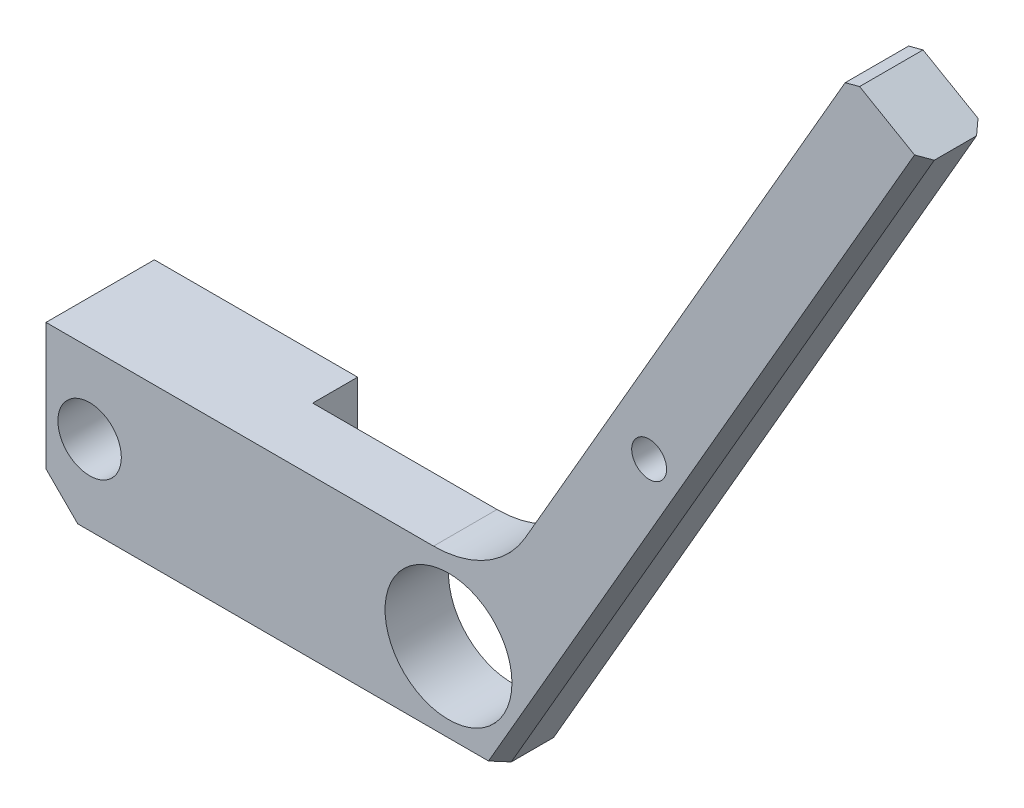
ISO-10303-21;
HEADER;
FILE_DESCRIPTION(('STEP AP214'),'2;1');
FILE_NAME('part.step','',(''),(''),'','','');
FILE_SCHEMA(('AUTOMOTIVE_DESIGN { 1 0 10303 214 1 1 1 1 }'));
ENDSEC;
DATA;
#1=APPLICATION_CONTEXT('core data for automotive mechanical design processes');
#2=APPLICATION_PROTOCOL_DEFINITION('international standard','automotive_design',2000,#1);
#3=PRODUCT_CONTEXT('',#1,'mechanical');
#4=PRODUCT('Part','Part','',(#3));
#5=PRODUCT_RELATED_PRODUCT_CATEGORY('part','',(#4));
#6=PRODUCT_DEFINITION_FORMATION('','',#4);
#7=PRODUCT_DEFINITION_CONTEXT('part definition',#1,'design');
#8=PRODUCT_DEFINITION('design','',#6,#7);
#9=PRODUCT_DEFINITION_SHAPE('','',#8);
#10=(LENGTH_UNIT() NAMED_UNIT(*) SI_UNIT(.MILLI.,.METRE.));
#11=(NAMED_UNIT(*) PLANE_ANGLE_UNIT() SI_UNIT($,.RADIAN.));
#12=(NAMED_UNIT(*) SI_UNIT($,.STERADIAN.) SOLID_ANGLE_UNIT());
#13=UNCERTAINTY_MEASURE_WITH_UNIT(LENGTH_MEASURE(1.E-05),#10,'distance_accuracy_value','');
#14=(GEOMETRIC_REPRESENTATION_CONTEXT(3) GLOBAL_UNCERTAINTY_ASSIGNED_CONTEXT((#13)) GLOBAL_UNIT_ASSIGNED_CONTEXT((#10,
#11,#12)) REPRESENTATION_CONTEXT('',''));
#15=CARTESIAN_POINT('',(0.,0.,0.));
#16=DIRECTION('',(0.,0.,1.));
#17=DIRECTION('',(1.,0.,0.));
#18=AXIS2_PLACEMENT_3D('',#15,#16,#17);
#19=CARTESIAN_POINT('',(-20.5267441860465,-13.0063953488372,-6.));
#20=DIRECTION('',(-1.,0.,0.));
#21=DIRECTION('',(0.,0.,1.));
#22=AXIS2_PLACEMENT_3D('',#19,#20,#21);
#23=PLANE('',#22);
#24=CARTESIAN_POINT('',(-20.5267441860465,-5.50639534883722,-5.125));
#25=DIRECTION('',(-1.,0.,0.));
#26=DIRECTION('',(0.,0.,1.));
#27=AXIS2_PLACEMENT_3D('',#24,#25,#26);
#28=CIRCLE('',#27,1.64999999999999);
#29=CARTESIAN_POINT('',(-20.5267441860465,-5.50639534883722,-3.47500000000001));
#30=VERTEX_POINT('',#29);
#31=EDGE_CURVE('E162',#30,#30,#28,.T.);
#32=ORIENTED_EDGE('',*,*,#31,.F.);
#33=EDGE_LOOP('',(#32));
#34=FACE_BOUND('',#33,.T.);
#35=DIRECTION('',(0.,0.,1.));
#36=VECTOR('',#35,1.);
#37=CARTESIAN_POINT('',(-20.5267441860465,1.99360465116279,-6.));
#38=LINE('',#37,#36);
#39=CARTESIAN_POINT('',(-20.5267441860465,1.99360465116279,-10.25));
#40=VERTEX_POINT('',#39);
#41=CARTESIAN_POINT('',(-20.5267441860465,1.99360465116279,0.));
#42=VERTEX_POINT('',#41);
#43=EDGE_CURVE('E134',#40,#42,#38,.T.);
#44=ORIENTED_EDGE('',*,*,#43,.F.);
#45=DIRECTION('',(0.,1.,0.));
#46=VECTOR('',#45,1.);
#47=CARTESIAN_POINT('',(-20.5267441860465,1.99360465116279,-10.25));
#48=LINE('',#47,#46);
#49=CARTESIAN_POINT('',(-20.5267441860465,-10.0063953488372,-10.25));
#50=VERTEX_POINT('',#49);
#51=EDGE_CURVE('E138',#50,#40,#48,.T.);
#52=ORIENTED_EDGE('',*,*,#51,.F.);
#53=DIRECTION('',(0.,0.,1.));
#54=VECTOR('',#53,1.);
#55=CARTESIAN_POINT('',(-20.5267441860465,-10.0063953488372,-6.));
#56=LINE('',#55,#54);
#57=CARTESIAN_POINT('',(-20.5267441860465,-10.0063953488372,0.));
#58=VERTEX_POINT('',#57);
#59=EDGE_CURVE('E144',#50,#58,#56,.T.);
#60=ORIENTED_EDGE('',*,*,#59,.T.);
#61=DIRECTION('',(0.,-1.,0.));
#62=VECTOR('',#61,1.);
#63=CARTESIAN_POINT('',(-20.5267441860465,-13.0063953488372,0.));
#64=LINE('',#63,#62);
#65=EDGE_CURVE('E140',#42,#58,#64,.T.);
#66=ORIENTED_EDGE('',*,*,#65,.F.);
#67=EDGE_LOOP('',(#44,#52,#60,#66));
#68=FACE_BOUND('',#67,.T.);
#69=ADVANCED_FACE('F35',(#34,#68),#23,.T.);
#70=CARTESIAN_POINT('',(16.1224028528676,1.99360465116279,-6.));
#71=DIRECTION('',(0.,1.,0.));
#72=DIRECTION('',(-1.,0.,0.));
#73=AXIS2_PLACEMENT_3D('',#70,#71,#72);
#74=PLANE('',#73);
#75=DIRECTION('',(-1.,0.,0.));
#76=VECTOR('',#75,1.);
#77=CARTESIAN_POINT('',(16.1224028528676,1.99360465116279,0.));
#78=LINE('',#77,#76);
#79=CARTESIAN_POINT('',(16.1224028528676,1.99360465116279,0.));
#80=VERTEX_POINT('',#79);
#81=EDGE_CURVE('E193',#80,#42,#78,.T.);
#82=ORIENTED_EDGE('',*,*,#81,.F.);
#83=DIRECTION('',(0.,0.,1.));
#84=VECTOR('',#83,1.);
#85=CARTESIAN_POINT('',(16.1224028528676,1.99360465116279,-6.));
#86=LINE('',#85,#84);
#87=CARTESIAN_POINT('',(16.1224028528676,1.99360465116279,-6.));
#88=VERTEX_POINT('',#87);
#89=EDGE_CURVE('E145',#88,#80,#86,.T.);
#90=ORIENTED_EDGE('',*,*,#89,.F.);
#91=DIRECTION('',(-1.,0.,0.));
#92=VECTOR('',#91,1.);
#93=CARTESIAN_POINT('',(16.1224028528676,1.99360465116279,-6.));
#94=LINE('',#93,#92);
#95=CARTESIAN_POINT('',(-1.30664462895203,1.99360465116279,-6.));
#96=VERTEX_POINT('',#95);
#97=EDGE_CURVE('E201',#88,#96,#94,.T.);
#98=ORIENTED_EDGE('',*,*,#97,.T.);
#99=DIRECTION('',(0.,0.,1.));
#100=VECTOR('',#99,1.);
#101=CARTESIAN_POINT('',(-1.30664462895203,1.99360465116279,-10.25));
#102=LINE('',#101,#100);
#103=CARTESIAN_POINT('',(-1.30664462895203,1.99360465116279,-10.25));
#104=VERTEX_POINT('',#103);
#105=EDGE_CURVE('E151',#104,#96,#102,.T.);
#106=ORIENTED_EDGE('',*,*,#105,.F.);
#107=DIRECTION('',(1.,0.,0.));
#108=VECTOR('',#107,1.);
#109=CARTESIAN_POINT('',(-20.5267441860465,1.99360465116279,-10.25));
#110=LINE('',#109,#108);
#111=EDGE_CURVE('E148',#40,#104,#110,.T.);
#112=ORIENTED_EDGE('',*,*,#111,.F.);
#113=ORIENTED_EDGE('',*,*,#43,.T.);
#114=EDGE_LOOP('',(#82,#90,#98,#106,#112,#113));
#115=FACE_BOUND('',#114,.T.);
#116=ADVANCED_FACE('F149',(#115),#74,.T.);
#117=CARTESIAN_POINT('',(16.1224028528676,11.9936046511628,-6.));
#118=DIRECTION('',(0.,0.,1.));
#119=DIRECTION('',(1.,0.,0.));
#120=AXIS2_PLACEMENT_3D('',#117,#118,#119);
#121=CYLINDRICAL_SURFACE('',#120,10.);
#122=CARTESIAN_POINT('',(16.1224028528676,11.9936046511628,0.));
#123=DIRECTION('',(0.,0.,-1.));
#124=DIRECTION('',(-1.,0.,0.));
#125=AXIS2_PLACEMENT_3D('',#122,#123,#124);
#126=CIRCLE('',#125,10.);
#127=CARTESIAN_POINT('',(24.782656890712,6.99360465116282,0.));
#128=VERTEX_POINT('',#127);
#129=EDGE_CURVE('E212',#128,#80,#126,.T.);
#130=ORIENTED_EDGE('',*,*,#129,.F.);
#131=DIRECTION('',(0.,0.,1.));
#132=VECTOR('',#131,1.);
#133=CARTESIAN_POINT('',(24.782656890712,6.99360465116282,-6.));
#134=LINE('',#133,#132);
#135=CARTESIAN_POINT('',(24.782656890712,6.99360465116282,-6.));
#136=VERTEX_POINT('',#135);
#137=EDGE_CURVE('E217',#136,#128,#134,.T.);
#138=ORIENTED_EDGE('',*,*,#137,.F.);
#139=CARTESIAN_POINT('',(16.1224028528676,11.9936046511628,-6.));
#140=DIRECTION('',(0.,0.,-1.));
#141=DIRECTION('',(-1.,0.,0.));
#142=AXIS2_PLACEMENT_3D('',#139,#140,#141);
#143=CIRCLE('',#142,10.);
#144=EDGE_CURVE('E198',#136,#88,#143,.T.);
#145=ORIENTED_EDGE('',*,*,#144,.T.);
#146=ORIENTED_EDGE('',*,*,#89,.T.);
#147=EDGE_LOOP('',(#130,#138,#145,#146));
#148=FACE_BOUND('',#147,.T.);
#149=ADVANCED_FACE('F297',(#148),#121,.F.);
#150=CARTESIAN_POINT('',(55.5450525836778,60.275636953918,-6.));
#151=DIRECTION('',(-0.86602540378444,0.499999999999998,0.));
#152=DIRECTION('',(-0.499999999999998,-0.86602540378444,0.));
#153=AXIS2_PLACEMENT_3D('',#150,#151,#152);
#154=PLANE('',#153);
#155=DIRECTION('',(-0.499999999999998,-0.86602540378444,0.));
#156=VECTOR('',#155,1.);
#157=CARTESIAN_POINT('',(55.5450525836778,60.275636953918,0.));
#158=LINE('',#157,#156);
#159=CARTESIAN_POINT('',(55.0450525836778,59.4096115501335,0.));
#160=VERTEX_POINT('',#159);
#161=EDGE_CURVE('E210',#160,#128,#158,.T.);
#162=ORIENTED_EDGE('',*,*,#161,.F.);
#163=DIRECTION('',(0.,0.,-1.));
#164=VECTOR('',#163,1.);
#165=CARTESIAN_POINT('',(55.0450525836778,59.4096115501335,-6.));
#166=LINE('',#165,#164);
#167=CARTESIAN_POINT('',(55.0450525836778,59.4096115501335,-6.));
#168=VERTEX_POINT('',#167);
#169=EDGE_CURVE('E46',#160,#168,#166,.T.);
#170=ORIENTED_EDGE('',*,*,#169,.T.);
#171=DIRECTION('',(-0.499999999999998,-0.86602540378444,0.));
#172=VECTOR('',#171,1.);
#173=CARTESIAN_POINT('',(55.5450525836778,60.275636953918,-6.));
#174=LINE('',#173,#172);
#175=EDGE_CURVE('E196',#168,#136,#174,.T.);
#176=ORIENTED_EDGE('',*,*,#175,.T.);
#177=ORIENTED_EDGE('',*,*,#137,.T.);
#178=EDGE_LOOP('',(#162,#170,#176,#177));
#179=FACE_BOUND('',#178,.T.);
#180=ADVANCED_FACE('F257',(#179),#154,.T.);
#181=CARTESIAN_POINT('',(62.4732558139534,56.275636953918,-6.));
#182=DIRECTION('',(0.499999999999999,0.866025403784439,0.));
#183=DIRECTION('',(-0.866025403784439,0.499999999999999,0.));
#184=AXIS2_PLACEMENT_3D('',#181,#182,#183);
#185=PLANE('',#184);
#186=DIRECTION('',(0.,0.,1.));
#187=VECTOR('',#186,1.);
#188=CARTESIAN_POINT('',(62.4732558139534,56.275636953918,-6.));
#189=LINE('',#188,#187);
#190=CARTESIAN_POINT('',(62.4732558139534,56.275636953918,-5.));
#191=VERTEX_POINT('',#190);
#192=CARTESIAN_POINT('',(62.4732558139534,56.275636953918,-1.));
#193=VERTEX_POINT('',#192);
#194=EDGE_CURVE('E220',#191,#193,#189,.T.);
#195=ORIENTED_EDGE('',*,*,#194,.F.);
#196=DIRECTION('',(0.612372435695797,-0.353553390593274,0.707106781186545));
#197=VECTOR('',#196,1.);
#198=CARTESIAN_POINT('',(62.0402431120611,56.525636953918,-5.5));
#199=LINE('',#198,#197);
#200=CARTESIAN_POINT('',(61.6072304101689,56.775636953918,-6.));
#201=VERTEX_POINT('',#200);
#202=EDGE_CURVE('E240',#191,#201,#199,.F.);
#203=ORIENTED_EDGE('',*,*,#202,.T.);
#204=DIRECTION('',(-0.866025403784439,0.499999999999999,0.));
#205=VECTOR('',#204,1.);
#206=CARTESIAN_POINT('',(62.4732558139534,56.275636953918,-6.));
#207=LINE('',#206,#205);
#208=CARTESIAN_POINT('',(56.4110779874623,59.775636953918,-6.));
#209=VERTEX_POINT('',#208);
#210=EDGE_CURVE('E192',#201,#209,#207,.T.);
#211=ORIENTED_EDGE('',*,*,#210,.T.);
#212=DIRECTION('',(0.,0.,1.));
#213=VECTOR('',#212,1.);
#214=CARTESIAN_POINT('',(56.4110779874623,59.775636953918,-6.));
#215=LINE('',#214,#213);
#216=CARTESIAN_POINT('',(56.4110779874623,59.775636953918,0.));
#217=VERTEX_POINT('',#216);
#218=EDGE_CURVE('E235',#209,#217,#215,.T.);
#219=ORIENTED_EDGE('',*,*,#218,.T.);
#220=DIRECTION('',(-0.866025403784439,0.499999999999999,0.));
#221=VECTOR('',#220,1.);
#222=CARTESIAN_POINT('',(62.4732558139534,56.275636953918,0.));
#223=LINE('',#222,#221);
#224=CARTESIAN_POINT('',(61.6072304101689,56.775636953918,0.));
#225=VERTEX_POINT('',#224);
#226=EDGE_CURVE('E208',#225,#217,#223,.T.);
#227=ORIENTED_EDGE('',*,*,#226,.F.);
#228=DIRECTION('',(0.612372435695798,-0.353553390593275,-0.707106781186544));
#229=VECTOR('',#228,1.);
#230=CARTESIAN_POINT('',(64.6383193234144,55.025636953918,-3.49999999999998));
#231=LINE('',#230,#229);
#232=EDGE_CURVE('E238',#225,#193,#231,.T.);
#233=ORIENTED_EDGE('',*,*,#232,.T.);
#234=EDGE_LOOP('',(#195,#203,#211,#219,#227,#233));
#235=FACE_BOUND('',#234,.T.);
#236=ADVANCED_FACE('F270',(#235),#185,.T.);
#237=CARTESIAN_POINT('',(62.4732558139534,56.275636953918,-6.));
#238=DIRECTION('',(0.86602540378444,-0.499999999999998,0.));
#239=DIRECTION('',(0.499999999999998,0.86602540378444,0.));
#240=AXIS2_PLACEMENT_3D('',#237,#238,#239);
#241=PLANE('',#240);
#242=DIRECTION('',(0.,0.,1.));
#243=VECTOR('',#242,1.);
#244=CARTESIAN_POINT('',(22.4732558139535,-13.0063953488372,-6.));
#245=LINE('',#244,#243);
#246=CARTESIAN_POINT('',(22.4732558139535,-13.0063953488372,-5.));
#247=VERTEX_POINT('',#246);
#248=CARTESIAN_POINT('',(22.4732558139535,-13.0063953488372,-1.));
#249=VERTEX_POINT('',#248);
#250=EDGE_CURVE('E203',#247,#249,#245,.T.);
#251=ORIENTED_EDGE('',*,*,#250,.F.);
#252=DIRECTION('',(0.499999999999998,0.86602540378444,0.));
#253=VECTOR('',#252,1.);
#254=CARTESIAN_POINT('',(62.4732558139534,56.275636953918,-5.));
#255=LINE('',#254,#253);
#256=EDGE_CURVE('E232',#247,#191,#255,.T.);
#257=ORIENTED_EDGE('',*,*,#256,.T.);
#258=ORIENTED_EDGE('',*,*,#194,.T.);
#259=DIRECTION('',(-0.499999999999998,-0.86602540378444,0.));
#260=VECTOR('',#259,1.);
#261=CARTESIAN_POINT('',(22.4732558139535,-13.0063953488372,-1.));
#262=LINE('',#261,#260);
#263=EDGE_CURVE('E230',#193,#249,#262,.T.);
#264=ORIENTED_EDGE('',*,*,#263,.T.);
#265=EDGE_LOOP('',(#251,#257,#258,#264));
#266=FACE_BOUND('',#265,.T.);
#267=ADVANCED_FACE('F280',(#266),#241,.T.);
#268=CARTESIAN_POINT('',(22.4732558139535,-13.0063953488372,-6.));
#269=DIRECTION('',(0.,-1.,0.));
#270=DIRECTION('',(1.,0.,0.));
#271=AXIS2_PLACEMENT_3D('',#268,#269,#270);
#272=PLANE('',#271);
#273=DIRECTION('',(0.,0.,-1.));
#274=VECTOR('',#273,1.);
#275=CARTESIAN_POINT('',(-17.5267441860464,-13.0063953488372,-6.));
#276=LINE('',#275,#274);
#277=CARTESIAN_POINT('',(-17.5267441860464,-13.0063953488372,0.));
#278=VERTEX_POINT('',#277);
#279=CARTESIAN_POINT('',(-17.5267441860464,-13.0063953488372,-10.25));
#280=VERTEX_POINT('',#279);
#281=EDGE_CURVE('E228',#278,#280,#276,.T.);
#282=ORIENTED_EDGE('',*,*,#281,.T.);
#283=DIRECTION('',(-1.,0.,0.));
#284=VECTOR('',#283,1.);
#285=CARTESIAN_POINT('',(-17.5267441860464,-13.0063953488372,-10.25));
#286=LINE('',#285,#284);
#287=CARTESIAN_POINT('',(-1.30664462895203,-13.0063953488372,-10.25));
#288=VERTEX_POINT('',#287);
#289=EDGE_CURVE('E168',#288,#280,#286,.T.);
#290=ORIENTED_EDGE('',*,*,#289,.F.);
#291=DIRECTION('',(0.,0.,1.));
#292=VECTOR('',#291,1.);
#293=CARTESIAN_POINT('',(-1.30664462895203,-13.0063953488372,-10.25));
#294=LINE('',#293,#292);
#295=CARTESIAN_POINT('',(-1.30664462895203,-13.0063953488372,-6.));
#296=VERTEX_POINT('',#295);
#297=EDGE_CURVE('E170',#288,#296,#294,.T.);
#298=ORIENTED_EDGE('',*,*,#297,.T.);
#299=DIRECTION('',(1.,0.,0.));
#300=VECTOR('',#299,1.);
#301=CARTESIAN_POINT('',(22.4732558139535,-13.0063953488372,-6.));
#302=LINE('',#301,#300);
#303=CARTESIAN_POINT('',(21.3185552755743,-13.0063953488372,-6.));
#304=VERTEX_POINT('',#303);
#305=EDGE_CURVE('E190',#296,#304,#302,.T.);
#306=ORIENTED_EDGE('',*,*,#305,.T.);
#307=DIRECTION('',(-0.755928946018456,0.,-0.654653670707975));
#308=VECTOR('',#307,1.);
#309=CARTESIAN_POINT('',(21.9783841546482,-13.0063953488372,-5.42857142857143));
#310=LINE('',#309,#308);
#311=EDGE_CURVE('E249',#304,#247,#310,.F.);
#312=ORIENTED_EDGE('',*,*,#311,.T.);
#313=ORIENTED_EDGE('',*,*,#250,.T.);
#314=DIRECTION('',(-0.755928946018457,0.,0.654653670707974));
#315=VECTOR('',#314,1.);
#316=CARTESIAN_POINT('',(24.9476141104805,-13.0063953488372,-3.14285714285712));
#317=LINE('',#316,#315);
#318=CARTESIAN_POINT('',(21.3185552755743,-13.0063953488372,0.));
#319=VERTEX_POINT('',#318);
#320=EDGE_CURVE('E247',#249,#319,#317,.T.);
#321=ORIENTED_EDGE('',*,*,#320,.T.);
#322=DIRECTION('',(1.,0.,0.));
#323=VECTOR('',#322,1.);
#324=CARTESIAN_POINT('',(22.4732558139535,-13.0063953488372,0.));
#325=LINE('',#324,#323);
#326=EDGE_CURVE('E205',#278,#319,#325,.T.);
#327=ORIENTED_EDGE('',*,*,#326,.F.);
#328=EDGE_LOOP('',(#282,#290,#298,#306,#312,#313,#321,#327));
#329=FACE_BOUND('',#328,.T.);
#330=ADVANCED_FACE('F291',(#329),#272,.T.);
#331=CARTESIAN_POINT('',(16.1224028528676,11.9936046511628,-6.));
#332=DIRECTION('',(0.,0.,-1.));
#333=DIRECTION('',(-1.,0.,0.));
#334=AXIS2_PLACEMENT_3D('',#331,#332,#333);
#335=PLANE('',#334);
#336=DIRECTION('',(0.,-1.,0.));
#337=VECTOR('',#336,1.);
#338=CARTESIAN_POINT('',(-1.30664462895203,1.99360465116279,-6.));
#339=LINE('',#338,#337);
#340=EDGE_CURVE('E53',#96,#296,#339,.T.);
#341=ORIENTED_EDGE('',*,*,#340,.F.);
#342=ORIENTED_EDGE('',*,*,#97,.F.);
#343=ORIENTED_EDGE('',*,*,#144,.F.);
#344=ORIENTED_EDGE('',*,*,#175,.F.);
#345=DIRECTION('',(-0.965925826289064,-0.258819045102536,0.));
#346=VECTOR('',#345,1.);
#347=CARTESIAN_POINT('',(6.87572426878705,46.5026789282081,-6.));
#348=LINE('',#347,#346);
#349=EDGE_CURVE('E242',#168,#209,#348,.F.);
#350=ORIENTED_EDGE('',*,*,#349,.T.);
#351=ORIENTED_EDGE('',*,*,#210,.F.);
#352=DIRECTION('',(-0.499999999999998,-0.86602540378444,0.));
#353=VECTOR('',#352,1.);
#354=CARTESIAN_POINT('',(30.8448347172031,3.49360465116282,-6.));
#355=LINE('',#354,#353);
#356=EDGE_CURVE('E244',#201,#304,#355,.T.);
#357=ORIENTED_EDGE('',*,*,#356,.T.);
#358=ORIENTED_EDGE('',*,*,#305,.F.);
#359=EDGE_LOOP('',(#341,#342,#343,#344,#350,#351,#357,#358));
#360=FACE_BOUND('',#359,.T.);
#361=CARTESIAN_POINT('',(36.5091541988158,19.3044937836181,-6.));
#362=DIRECTION('',(0.,0.,1.));
#363=DIRECTION('',(1.,0.,0.));
#364=AXIS2_PLACEMENT_3D('',#361,#362,#363);
#365=CIRCLE('',#364,1.65);
#366=CARTESIAN_POINT('',(38.1591541988158,19.3044937836181,-6.));
#367=VERTEX_POINT('',#366);
#368=EDGE_CURVE('E178',#367,#367,#365,.T.);
#369=ORIENTED_EDGE('',*,*,#368,.T.);
#370=EDGE_LOOP('',(#369));
#371=FACE_BOUND('',#370,.T.);
#372=CARTESIAN_POINT('',(17.5353455925553,-5.50639534883722,-6.));
#373=DIRECTION('',(0.,0.,1.));
#374=DIRECTION('',(1.,0.,0.));
#375=AXIS2_PLACEMENT_3D('',#372,#373,#374);
#376=CIRCLE('',#375,6.);
#377=CARTESIAN_POINT('',(23.5353455925553,-5.50639534883722,-6.));
#378=VERTEX_POINT('',#377);
#379=EDGE_CURVE('E182',#378,#378,#376,.T.);
#380=ORIENTED_EDGE('',*,*,#379,.T.);
#381=EDGE_LOOP('',(#380));
#382=FACE_BOUND('',#381,.T.);
#383=ADVANCED_FACE('F262',(#360,#371,#382),#335,.T.);
#384=CARTESIAN_POINT('',(16.1224028528676,11.9936046511628,0.));
#385=DIRECTION('',(0.,0.,-1.));
#386=DIRECTION('',(-1.,0.,0.));
#387=AXIS2_PLACEMENT_3D('',#384,#385,#386);
#388=PLANE('',#387);
#389=CARTESIAN_POINT('',(36.5091541988158,19.3044937836181,0.));
#390=DIRECTION('',(0.,0.,1.));
#391=DIRECTION('',(1.,0.,0.));
#392=AXIS2_PLACEMENT_3D('',#389,#390,#391);
#393=CIRCLE('',#392,1.64999999999999);
#394=CARTESIAN_POINT('',(38.1591541988158,19.3044937836181,0.));
#395=VERTEX_POINT('',#394);
#396=EDGE_CURVE('E175',#395,#395,#393,.T.);
#397=ORIENTED_EDGE('',*,*,#396,.F.);
#398=EDGE_LOOP('',(#397));
#399=FACE_BOUND('',#398,.T.);
#400=CARTESIAN_POINT('',(17.5353455925553,-5.50639534883722,0.));
#401=DIRECTION('',(0.,0.,1.));
#402=DIRECTION('',(1.,0.,0.));
#403=AXIS2_PLACEMENT_3D('',#400,#401,#402);
#404=CIRCLE('',#403,6.);
#405=CARTESIAN_POINT('',(23.5353455925553,-5.50639534883722,0.));
#406=VERTEX_POINT('',#405);
#407=EDGE_CURVE('E181',#406,#406,#404,.T.);
#408=ORIENTED_EDGE('',*,*,#407,.F.);
#409=EDGE_LOOP('',(#408));
#410=FACE_BOUND('',#409,.T.);
#411=CARTESIAN_POINT('',(-16.4036125608839,-5.50639534883722,0.));
#412=DIRECTION('',(0.,0.,1.));
#413=DIRECTION('',(1.,0.,0.));
#414=AXIS2_PLACEMENT_3D('',#411,#412,#413);
#415=CIRCLE('',#414,3.);
#416=CARTESIAN_POINT('',(-13.4036125608839,-5.50639534883722,0.));
#417=VERTEX_POINT('',#416);
#418=EDGE_CURVE('E185',#417,#417,#415,.T.);
#419=ORIENTED_EDGE('',*,*,#418,.F.);
#420=EDGE_LOOP('',(#419));
#421=FACE_BOUND('',#420,.T.);
#422=ORIENTED_EDGE('',*,*,#326,.T.);
#423=DIRECTION('',(0.499999999999998,0.86602540378444,0.));
#424=VECTOR('',#423,1.);
#425=CARTESIAN_POINT('',(61.6072304101689,56.775636953918,0.));
#426=LINE('',#425,#424);
#427=EDGE_CURVE('E252',#319,#225,#426,.T.);
#428=ORIENTED_EDGE('',*,*,#427,.T.);
#429=ORIENTED_EDGE('',*,*,#226,.T.);
#430=DIRECTION('',(0.965925826289064,0.258819045102536,0.));
#431=VECTOR('',#430,1.);
#432=CARTESIAN_POINT('',(56.4110779874623,59.775636953918,0.));
#433=LINE('',#432,#431);
#434=EDGE_CURVE('E61',#217,#160,#433,.F.);
#435=ORIENTED_EDGE('',*,*,#434,.T.);
#436=ORIENTED_EDGE('',*,*,#161,.T.);
#437=ORIENTED_EDGE('',*,*,#129,.T.);
#438=ORIENTED_EDGE('',*,*,#81,.T.);
#439=ORIENTED_EDGE('',*,*,#65,.T.);
#440=DIRECTION('',(-0.707106781186548,0.707106781186548,0.));
#441=VECTOR('',#440,1.);
#442=CARTESIAN_POINT('',(-20.5267441860465,-10.0063953488372,0.));
#443=LINE('',#442,#441);
#444=EDGE_CURVE('E226',#58,#278,#443,.F.);
#445=ORIENTED_EDGE('',*,*,#444,.T.);
#446=EDGE_LOOP('',(#422,#428,#429,#435,#436,#437,#438,#439,#445));
#447=FACE_BOUND('',#446,.T.);
#448=ADVANCED_FACE('F271',(#399,#410,#421,#447),#388,.F.);
#449=CARTESIAN_POINT('',(-16.4036125608839,-5.50639534883722,-6.));
#450=DIRECTION('',(0.,0.,1.));
#451=DIRECTION('',(1.,0.,0.));
#452=AXIS2_PLACEMENT_3D('',#449,#450,#451);
#453=CYLINDRICAL_SURFACE('',#452,3.);
#454=CARTESIAN_POINT('',(-19.0575012171767,-6.90527883219099,-6.));
#455=CARTESIAN_POINT('',(-19.0343089832289,-6.94927570338399,-5.92965652888885));
#456=CARTESIAN_POINT('',(-19.0123872179448,-6.98820778641558,-5.85560716025293));
#457=CARTESIAN_POINT('',(-18.9734319719071,-7.05479140578722,-5.70123502515159));
#458=CARTESIAN_POINT('',(-18.9564061097569,-7.08242538883044,-5.62090272612121));
#459=CARTESIAN_POINT('',(-18.929457740168,-7.12527200782411,-5.45527598167875));
#460=CARTESIAN_POINT('',(-18.9195752994175,-7.14041464704492,-5.36995640459624));
#461=CARTESIAN_POINT('',(-18.9086835058304,-7.15707097120218,-5.19750117036288));
#462=CARTESIAN_POINT('',(-18.9076633261349,-7.15860128611596,-5.11036785957145));
#463=CARTESIAN_POINT('',(-18.9143241097662,-7.1484513581698,-4.9449680185072));
#464=CARTESIAN_POINT('',(-18.9212480189316,-7.1379206604982,-4.86659540618177));
#465=CARTESIAN_POINT('',(-18.94161777594,-7.10604588786152,-4.71295502176893));
#466=CARTESIAN_POINT('',(-18.9550674098935,-7.08469553520332,-4.63768907965739));
#467=CARTESIAN_POINT('',(-18.9873526420901,-7.03128278198777,-4.48971029562089));
#468=CARTESIAN_POINT('',(-19.0063355773688,-6.99892263582298,-4.41713850746008));
#469=CARTESIAN_POINT('',(-19.0475420775667,-6.92464754466952,-4.27807443033121));
#470=CARTESIAN_POINT('',(-19.069767105659,-6.88272828076516,-4.21158490848321));
#471=CARTESIAN_POINT('',(-19.1191660798718,-6.78285017406124,-4.0755425059913));
#472=CARTESIAN_POINT('',(-19.1465677990915,-6.72340445959024,-4.00715965158481));
#473=CARTESIAN_POINT('',(-19.2004446874176,-6.59389398741952,-3.88079800357553));
#474=CARTESIAN_POINT('',(-19.2269192333571,-6.52382225024627,-3.82282610325406));
#475=CARTESIAN_POINT('',(-19.2780422519435,-6.36934749596787,-3.7153094546071));
#476=CARTESIAN_POINT('',(-19.3024595602213,-6.28430839076326,-3.66655926477569));
#477=CARTESIAN_POINT('',(-19.3445988240815,-6.10556165112493,-3.58449883452917));
#478=CARTESIAN_POINT('',(-19.3623271336696,-6.01186234907037,-3.55117393448011));
#479=CARTESIAN_POINT('',(-19.3876404916638,-5.82790775897072,-3.50411278991187));
#480=CARTESIAN_POINT('',(-19.3960243092355,-5.73816072897969,-3.4888258556299));
#481=CARTESIAN_POINT('',(-19.4045524814498,-5.55700524465116,-3.47327751872591));
#482=CARTESIAN_POINT('',(-19.4047019998786,-5.46559786751129,-3.47300669939306));
#483=CARTESIAN_POINT('',(-19.3971496410523,-5.29317348948083,-3.48677311148484));
#484=CARTESIAN_POINT('',(-19.3902061737313,-5.21200701862426,-3.4994282332709));
#485=CARTESIAN_POINT('',(-19.3702581883263,-5.05315907499372,-3.53637552943887));
#486=CARTESIAN_POINT('',(-19.3572530395744,-4.975477965765,-3.56066891469336));
#487=CARTESIAN_POINT('',(-19.3259303586184,-4.82359201471492,-3.62063657940856));
#488=CARTESIAN_POINT('',(-19.3074932400464,-4.74951470313737,-3.65656909253474));
#489=CARTESIAN_POINT('',(-19.2669548323881,-4.6082414197331,-3.73845970592121));
#490=CARTESIAN_POINT('',(-19.2448521815717,-4.54104802031502,-3.78442153404162));
#491=CARTESIAN_POINT('',(-19.1960731996459,-4.40740788200096,-3.89097079208097));
#492=CARTESIAN_POINT('',(-19.169162020402,-4.34189372982447,-3.95262140305016));
#493=CARTESIAN_POINT('',(-19.1153925933207,-4.22163959616191,-4.08578678419086));
#494=CARTESIAN_POINT('',(-19.0885344295041,-4.16691087712964,-4.15731173432061));
#495=CARTESIAN_POINT('',(-19.0356987886503,-4.06569232617261,-4.31487941608112));
#496=CARTESIAN_POINT('',(-19.0099450611293,-4.02015037868447,-4.40161359802787));
#497=CARTESIAN_POINT('',(-18.9654947464015,-3.94476287873541,-4.58330015766833));
#498=CARTESIAN_POINT('',(-18.9467873345384,-3.91489322228947,-4.67823965207118));
#499=CARTESIAN_POINT('',(-18.9211870445758,-3.87472807776324,-4.86375073514667));
#500=CARTESIAN_POINT('',(-18.9133079892082,-3.86278768517235,-4.95382444060042));
#501=CARTESIAN_POINT('',(-18.9074957141397,-3.85394024097679,-5.13502275609931));
#502=CARTESIAN_POINT('',(-18.9095567094914,-3.85702444531223,-5.22614672410789));
#503=CARTESIAN_POINT('',(-18.9222771638835,-3.87654129771717,-5.39375136526032));
#504=CARTESIAN_POINT('',(-18.9317433804646,-3.89112361454306,-5.470553682574));
#505=CARTESIAN_POINT('',(-18.9565449823608,-3.93061767133183,-5.62040033356062));
#506=CARTESIAN_POINT('',(-18.9718769030064,-3.95552331438417,-5.69344685681395));
#507=CARTESIAN_POINT('',(-18.9994687117004,-4.00242393665126,-5.80512583791378));
#508=CARTESIAN_POINT('',(-19.0103572889066,-4.02132704653086,-5.84544430279829));
#509=CARTESIAN_POINT('',(-19.0332074619157,-4.06217239044732,-5.92417825242004));
#510=CARTESIAN_POINT('',(-19.0451688558475,-4.08411405314291,-5.96259409306978));
#511=CARTESIAN_POINT('',(-19.0842030274495,-4.15817239425292,-6.08099060701088));
#512=CARTESIAN_POINT('',(-19.1126439381953,-4.2156593734157,-6.15724663027841));
#513=CARTESIAN_POINT('',(-19.1696994141474,-4.34293483734259,-6.29886299958716));
#514=CARTESIAN_POINT('',(-19.1983142281818,-4.41275127643549,-6.36419791490259));
#515=CARTESIAN_POINT('',(-19.2527109333192,-4.56349305293876,-6.48243045320539));
#516=CARTESIAN_POINT('',(-19.2784873424284,-4.64443923099209,-6.53530422612116));
#517=CARTESIAN_POINT('',(-19.3243237434008,-4.81555289839008,-6.626536541671));
#518=CARTESIAN_POINT('',(-19.3443910717853,-4.90570834879865,-6.66491373429427));
#519=CARTESIAN_POINT('',(-19.3754387861135,-5.08671837423207,-6.72338159920933));
#520=CARTESIAN_POINT('',(-19.3869201451556,-5.17715590802505,-6.74448870821126));
#521=CARTESIAN_POINT('',(-19.4014980511891,-5.36094601023942,-6.7711920148844));
#522=CARTESIAN_POINT('',(-19.4046000973804,-5.45429662613694,-6.77679838548262));
#523=CARTESIAN_POINT('',(-19.4022033155201,-5.63031204163103,-6.77243507900648));
#524=CARTESIAN_POINT('',(-19.3976025596047,-5.71303561788007,-6.76409193088982));
#525=CARTESIAN_POINT('',(-19.3819180714663,-5.87567725386705,-6.7352639514227));
#526=CARTESIAN_POINT('',(-19.3708351156502,-5.9555956483813,-6.71478057416707));
#527=CARTESIAN_POINT('',(-19.3431776865727,-6.11069365848195,-6.6625410752045));
#528=CARTESIAN_POINT('',(-19.3265981264798,-6.1858688074357,-6.63077450952181));
#529=CARTESIAN_POINT('',(-19.2893105592819,-6.32998385513917,-6.55704862051296));
#530=CARTESIAN_POINT('',(-19.2685984609057,-6.3989174755757,-6.51507918713781));
#531=CARTESIAN_POINT('',(-19.2223208038695,-6.53628670512688,-6.41715842790086));
#532=CARTESIAN_POINT('',(-19.196473914359,-6.60390798445618,-6.36020101157439));
#533=CARTESIAN_POINT('',(-19.1440303405934,-6.72897367246544,-6.23653672375444));
#534=CARTESIAN_POINT('',(-19.1174352822443,-6.78643843036718,-6.16984984696023));
#535=CARTESIAN_POINT('',(-19.080098891154,-6.86179607695168,-6.06679230375851));
#536=CARTESIAN_POINT('',(-19.0686531780197,-6.88412298382118,-6.03382458270964));
#537=CARTESIAN_POINT('',(-19.0575012171767,-6.90527883219099,-6.));
#538=B_SPLINE_CURVE_WITH_KNOTS('',3,(#454,#455,#456,#457,#458,#459,#460,#461,#462,#463,#464,
#465,#466,#467,#468,#469,#470,#471,#472,#473,#474,#475,#476,#477,#478,#479,#480,#481,#482,#483,
#484,#485,#486,#487,#488,#489,#490,#491,#492,#493,#494,#495,#496,#497,#498,#499,#500,#501,#502,
#503,#504,#505,#506,#507,#508,#509,#510,#511,#512,#513,#514,#515,#516,#517,#518,#519,#520,#521,
#522,#523,#524,#525,#526,#527,#528,#529,#530,#531,#532,#533,#534,#535,#536,#537),.UNSPECIFIED.,
.T.,.F.,(4,2,2,2,2,2,2,2,2,2,2,2,2,2,2,2,2,2,2,2,2,2,2,2,2,2,2,2,2,2,2,2,2,2,2,2,2,2,2,2,2,4),
(0.,0.258345077582403,0.517090021622771,0.777275209156314,1.03714248853315,1.27416420114091,
1.51132359430225,1.75548722745282,1.99976139578903,2.28255174415282,2.56552864828292,
2.86693204988988,3.16804841756538,3.44077356572356,3.71332768409579,3.95950567672122,
4.20570928785398,4.457799741147,4.70998405564528,4.99051001770745,5.27132737853255,
5.57358199835893,5.87537037772812,6.1472858090687,6.4190430091652,6.65426474559119,
6.88934775860133,7.02673351046438,7.1640934645727,7.46150280377072,7.75959531899695,
8.05825381891613,8.35652677250839,8.6356367780863,8.9145635639762,9.16317769686294,
9.41176205803092,9.66057711674503,9.90963973919217,10.1848879371351,10.4595782474929,
10.5838032012275),.UNSPECIFIED.);
#539=CARTESIAN_POINT('',(-19.0575012171767,-6.90527883219099,-6.));
#540=VERTEX_POINT('',#539);
#541=EDGE_CURVE('E11',#540,#540,#538,.T.);
#542=ORIENTED_EDGE('',*,*,#541,.T.);
#543=EDGE_LOOP('',(#542));
#544=FACE_BOUND('',#543,.T.);
#545=ORIENTED_EDGE('',*,*,#418,.T.);
#546=EDGE_LOOP('',(#545));
#547=FACE_BOUND('',#546,.T.);
#548=CARTESIAN_POINT('',(-16.4036125608839,-5.50639534883722,-10.25));
#549=DIRECTION('',(0.,0.,1.));
#550=DIRECTION('',(1.,0.,0.));
#551=AXIS2_PLACEMENT_3D('',#548,#549,#550);
#552=CIRCLE('',#551,3.);
#553=CARTESIAN_POINT('',(-13.4036125608839,-5.50639534883722,-10.25));
#554=VERTEX_POINT('',#553);
#555=EDGE_CURVE('E360',#554,#554,#552,.T.);
#556=ORIENTED_EDGE('',*,*,#555,.F.);
#557=EDGE_LOOP('',(#556));
#558=FACE_BOUND('',#557,.T.);
#559=ADVANCED_FACE('F340',(#544,#547,#558),#453,.F.);
#560=CARTESIAN_POINT('',(17.5353455925553,-5.50639534883722,-6.));
#561=DIRECTION('',(0.,0.,1.));
#562=DIRECTION('',(1.,0.,0.));
#563=AXIS2_PLACEMENT_3D('',#560,#561,#562);
#564=CYLINDRICAL_SURFACE('',#563,6.);
#565=ORIENTED_EDGE('',*,*,#379,.F.);
#566=EDGE_LOOP('',(#565));
#567=FACE_BOUND('',#566,.T.);
#568=ORIENTED_EDGE('',*,*,#407,.T.);
#569=EDGE_LOOP('',(#568));
#570=FACE_BOUND('',#569,.T.);
#571=ADVANCED_FACE('F337',(#567,#570),#564,.F.);
#572=CARTESIAN_POINT('',(36.5091541988158,19.3044937836181,0.));
#573=DIRECTION('',(0.,0.,1.));
#574=DIRECTION('',(1.,0.,0.));
#575=AXIS2_PLACEMENT_3D('',#572,#573,#574);
#576=CYLINDRICAL_SURFACE('',#575,1.65);
#577=ORIENTED_EDGE('',*,*,#368,.F.);
#578=EDGE_LOOP('',(#577));
#579=FACE_BOUND('',#578,.T.);
#580=ORIENTED_EDGE('',*,*,#396,.T.);
#581=EDGE_LOOP('',(#580));
#582=FACE_BOUND('',#581,.T.);
#583=ADVANCED_FACE('F317',(#579,#582),#576,.F.);
#584=CARTESIAN_POINT('',(-20.5267441860465,-10.0063953488372,-6.));
#585=DIRECTION('',(0.707106781186547,0.707106781186547,0.));
#586=DIRECTION('',(0.,0.,1.));
#587=AXIS2_PLACEMENT_3D('',#584,#585,#586);
#588=PLANE('',#587);
#589=ORIENTED_EDGE('',*,*,#59,.F.);
#590=DIRECTION('',(-0.707106781186548,0.707106781186548,0.));
#591=VECTOR('',#590,1.);
#592=CARTESIAN_POINT('',(-17.5267441860464,-13.0063953488372,-10.25));
#593=LINE('',#592,#591);
#594=EDGE_CURVE('E160',#280,#50,#593,.T.);
#595=ORIENTED_EDGE('',*,*,#594,.F.);
#596=ORIENTED_EDGE('',*,*,#281,.F.);
#597=ORIENTED_EDGE('',*,*,#444,.F.);
#598=EDGE_LOOP('',(#589,#595,#596,#597));
#599=FACE_BOUND('',#598,.T.);
#600=ADVANCED_FACE('F294',(#599),#588,.F.);
#601=CARTESIAN_POINT('',(62.4732558139534,56.275636953918,-5.));
#602=DIRECTION('',(-0.612372435695794,0.353553390593271,0.70710678118655));
#603=DIRECTION('',(0.499999999999998,0.86602540378444,0.));
#604=AXIS2_PLACEMENT_3D('',#601,#602,#603);
#605=PLANE('',#604);
#606=ORIENTED_EDGE('',*,*,#311,.F.);
#607=ORIENTED_EDGE('',*,*,#356,.F.);
#608=ORIENTED_EDGE('',*,*,#202,.F.);
#609=ORIENTED_EDGE('',*,*,#256,.F.);
#610=EDGE_LOOP('',(#606,#607,#608,#609));
#611=FACE_BOUND('',#610,.T.);
#612=ADVANCED_FACE('F284',(#611),#605,.F.);
#613=CARTESIAN_POINT('',(30.8448347172031,3.49360465116282,0.));
#614=DIRECTION('',(0.612372435695792,-0.35355339059327,0.707106781186551));
#615=DIRECTION('',(-0.499999999999998,-0.86602540378444,0.));
#616=AXIS2_PLACEMENT_3D('',#613,#614,#615);
#617=PLANE('',#616);
#618=ORIENTED_EDGE('',*,*,#320,.F.);
#619=ORIENTED_EDGE('',*,*,#263,.F.);
#620=ORIENTED_EDGE('',*,*,#232,.F.);
#621=ORIENTED_EDGE('',*,*,#427,.F.);
#622=EDGE_LOOP('',(#618,#619,#620,#621));
#623=FACE_BOUND('',#622,.T.);
#624=ADVANCED_FACE('F276',(#623),#617,.T.);
#625=CARTESIAN_POINT('',(56.4110779874623,59.775636953918,-6.));
#626=DIRECTION('',(0.258819045102536,-0.965925826289064,0.));
#627=DIRECTION('',(0.,0.,1.));
#628=AXIS2_PLACEMENT_3D('',#625,#626,#627);
#629=PLANE('',#628);
#630=ORIENTED_EDGE('',*,*,#349,.F.);
#631=ORIENTED_EDGE('',*,*,#169,.F.);
#632=ORIENTED_EDGE('',*,*,#434,.F.);
#633=ORIENTED_EDGE('',*,*,#218,.F.);
#634=EDGE_LOOP('',(#630,#631,#632,#633));
#635=FACE_BOUND('',#634,.T.);
#636=ADVANCED_FACE('F266',(#635),#629,.F.);
#637=CARTESIAN_POINT('',(0.,0.,-10.25));
#638=DIRECTION('',(0.,0.,1.));
#639=DIRECTION('',(1.,0.,0.));
#640=AXIS2_PLACEMENT_3D('',#637,#638,#639);
#641=PLANE('',#640);
#642=ORIENTED_EDGE('',*,*,#555,.T.);
#643=EDGE_LOOP('',(#642));
#644=FACE_BOUND('',#643,.T.);
#645=ORIENTED_EDGE('',*,*,#51,.T.);
#646=ORIENTED_EDGE('',*,*,#111,.T.);
#647=DIRECTION('',(0.,-1.,0.));
#648=VECTOR('',#647,1.);
#649=CARTESIAN_POINT('',(-1.30664462895203,1.99360465116279,-10.25));
#650=LINE('',#649,#648);
#651=EDGE_CURVE('E154',#104,#288,#650,.T.);
#652=ORIENTED_EDGE('',*,*,#651,.T.);
#653=ORIENTED_EDGE('',*,*,#289,.T.);
#654=ORIENTED_EDGE('',*,*,#594,.T.);
#655=EDGE_LOOP('',(#645,#646,#652,#653,#654));
#656=FACE_BOUND('',#655,.T.);
#657=ADVANCED_FACE('F157',(#644,#656),#641,.F.);
#658=CARTESIAN_POINT('',(-1.30664462895203,1.99360465116279,-10.25));
#659=DIRECTION('',(-1.,0.,0.));
#660=DIRECTION('',(0.,0.,1.));
#661=AXIS2_PLACEMENT_3D('',#658,#659,#660);
#662=PLANE('',#661);
#663=ORIENTED_EDGE('',*,*,#340,.T.);
#664=ORIENTED_EDGE('',*,*,#297,.F.);
#665=ORIENTED_EDGE('',*,*,#651,.F.);
#666=ORIENTED_EDGE('',*,*,#105,.T.);
#667=EDGE_LOOP('',(#663,#664,#665,#666));
#668=FACE_BOUND('',#667,.T.);
#669=ADVANCED_FACE('F289',(#668),#662,.F.);
#670=CARTESIAN_POINT('',(-20.5267441860465,-5.50639534883722,-5.125));
#671=DIRECTION('',(-1.,0.,0.));
#672=DIRECTION('',(0.,0.,1.));
#673=AXIS2_PLACEMENT_3D('',#670,#671,#672);
#674=CYLINDRICAL_SURFACE('',#673,1.64999999999999);
#675=ORIENTED_EDGE('',*,*,#541,.F.);
#676=EDGE_LOOP('',(#675));
#677=FACE_BOUND('',#676,.T.);
#678=ORIENTED_EDGE('',*,*,#31,.T.);
#679=EDGE_LOOP('',(#678));
#680=FACE_BOUND('',#679,.T.);
#681=ADVANCED_FACE('F330',(#677,#680),#674,.F.);
#682=CLOSED_SHELL('',(#69,#116,#149,#180,#236,#267,#330,#383,#448,#559,#571,#583,#600,#612,#624,
#636,#657,#669,#681));
#683=MANIFOLD_SOLID_BREP('B2',#682);
#684=ADVANCED_BREP_SHAPE_REPRESENTATION('',(#18,#683),#14);
#685=SHAPE_DEFINITION_REPRESENTATION(#9,#684);
ENDSEC;
END-ISO-10303-21;
